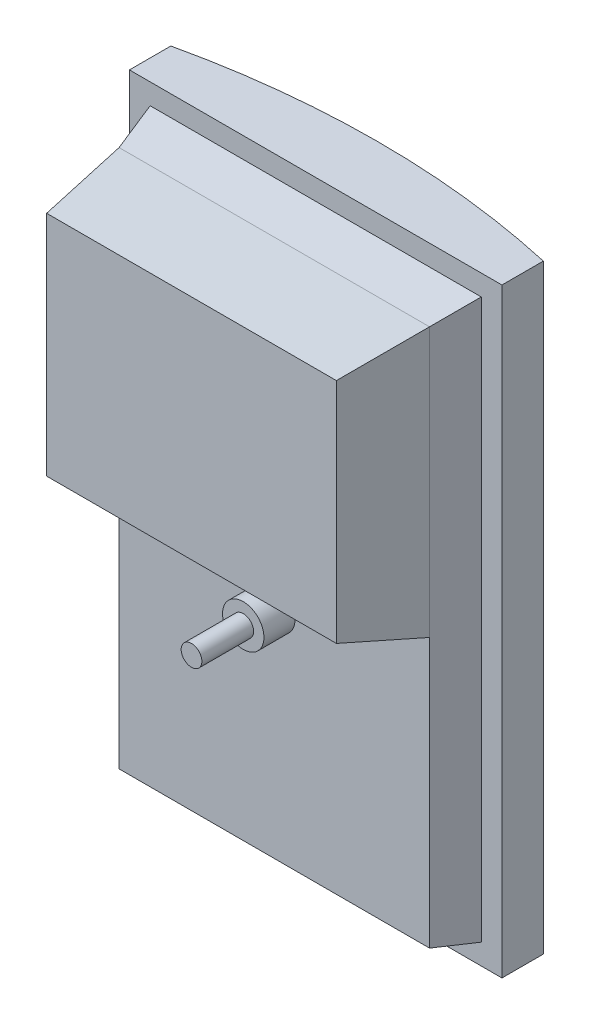
ISO-10303-21;
HEADER;
FILE_DESCRIPTION(('STEP AP214'),'2;1');
FILE_NAME('part.step','',(''),(''),'','','');
FILE_SCHEMA(('AUTOMOTIVE_DESIGN { 1 0 10303 214 1 1 1 1 }'));
ENDSEC;
DATA;
#1=APPLICATION_CONTEXT('core data for automotive mechanical design processes');
#2=APPLICATION_PROTOCOL_DEFINITION('international standard','automotive_design',2000,#1);
#3=PRODUCT_CONTEXT('',#1,'mechanical');
#4=PRODUCT('Part','Part','',(#3));
#5=PRODUCT_RELATED_PRODUCT_CATEGORY('part','',(#4));
#6=PRODUCT_DEFINITION_FORMATION('','',#4);
#7=PRODUCT_DEFINITION_CONTEXT('part definition',#1,'design');
#8=PRODUCT_DEFINITION('design','',#6,#7);
#9=PRODUCT_DEFINITION_SHAPE('','',#8);
#10=(LENGTH_UNIT() NAMED_UNIT(*) SI_UNIT(.MILLI.,.METRE.));
#11=(NAMED_UNIT(*) PLANE_ANGLE_UNIT() SI_UNIT($,.RADIAN.));
#12=(NAMED_UNIT(*) SI_UNIT($,.STERADIAN.) SOLID_ANGLE_UNIT());
#13=UNCERTAINTY_MEASURE_WITH_UNIT(LENGTH_MEASURE(1.E-05),#10,'distance_accuracy_value','');
#14=(GEOMETRIC_REPRESENTATION_CONTEXT(3) GLOBAL_UNCERTAINTY_ASSIGNED_CONTEXT((#13)) GLOBAL_UNIT_ASSIGNED_CONTEXT((#10,
#11,#12)) REPRESENTATION_CONTEXT('',''));
#15=CARTESIAN_POINT('',(0.,0.,0.));
#16=DIRECTION('',(0.,0.,1.));
#17=DIRECTION('',(1.,0.,0.));
#18=AXIS2_PLACEMENT_3D('',#15,#16,#17);
#19=CARTESIAN_POINT('',(0.,0.,15.875));
#20=DIRECTION('',(0.,0.,1.));
#21=DIRECTION('',(1.,0.,0.));
#22=AXIS2_PLACEMENT_3D('',#19,#20,#21);
#23=PLANE('',#22);
#24=CARTESIAN_POINT('',(0.,-25.4,15.875));
#25=DIRECTION('',(0.,0.,1.));
#26=DIRECTION('',(1.,0.,0.));
#27=AXIS2_PLACEMENT_3D('',#24,#25,#26);
#28=CIRCLE('',#27,3.175);
#29=CARTESIAN_POINT('',(3.175,-25.4,15.875));
#30=VERTEX_POINT('',#29);
#31=EDGE_CURVE('E693',#30,#30,#28,.T.);
#32=ORIENTED_EDGE('',*,*,#31,.F.);
#33=EDGE_LOOP('',(#32));
#34=FACE_BOUND('',#33,.T.);
#35=DIRECTION('',(0.,1.,0.));
#36=VECTOR('',#35,1.);
#37=CARTESIAN_POINT('',(23.8125,-58.7375,15.875));
#38=LINE('',#37,#36);
#39=CARTESIAN_POINT('',(23.8125,-58.7375,15.875));
#40=VERTEX_POINT('',#39);
#41=CARTESIAN_POINT('',(23.8125,-17.4625,15.875));
#42=VERTEX_POINT('',#41);
#43=EDGE_CURVE('E164',#40,#42,#38,.T.);
#44=ORIENTED_EDGE('',*,*,#43,.T.);
#45=DIRECTION('',(1.,0.,0.));
#46=VECTOR('',#45,1.);
#47=CARTESIAN_POINT('',(-23.8125,-17.4625,15.875));
#48=LINE('',#47,#46);
#49=CARTESIAN_POINT('',(-23.8125,-17.4625,15.875));
#50=VERTEX_POINT('',#49);
#51=EDGE_CURVE('E138',#50,#42,#48,.T.);
#52=ORIENTED_EDGE('',*,*,#51,.F.);
#53=DIRECTION('',(0.,-1.,0.));
#54=VECTOR('',#53,1.);
#55=CARTESIAN_POINT('',(-23.8125,23.8125,15.875));
#56=LINE('',#55,#54);
#57=CARTESIAN_POINT('',(-23.8125,-58.7375,15.875));
#58=VERTEX_POINT('',#57);
#59=EDGE_CURVE('E360',#50,#58,#56,.T.);
#60=ORIENTED_EDGE('',*,*,#59,.T.);
#61=DIRECTION('',(1.,0.,0.));
#62=VECTOR('',#61,1.);
#63=CARTESIAN_POINT('',(-23.8125,-58.7375,15.875));
#64=LINE('',#63,#62);
#65=EDGE_CURVE('E175',#58,#40,#64,.T.);
#66=ORIENTED_EDGE('',*,*,#65,.T.);
#67=EDGE_LOOP('',(#44,#52,#60,#66));
#68=FACE_BOUND('',#67,.T.);
#69=ADVANCED_FACE('F55',(#34,#68),#23,.T.);
#70=CARTESIAN_POINT('',(-28.575,-63.5,9.52500000000001));
#71=DIRECTION('',(0.,0.,1.));
#72=DIRECTION('',(1.,0.,0.));
#73=AXIS2_PLACEMENT_3D('',#70,#71,#72);
#74=PLANE('',#73);
#75=DIRECTION('',(0.,1.,0.));
#76=VECTOR('',#75,1.);
#77=CARTESIAN_POINT('',(28.575,-63.5,9.52500000000001));
#78=LINE('',#77,#76);
#79=CARTESIAN_POINT('',(28.575,-63.5,9.52500000000001));
#80=VERTEX_POINT('',#79);
#81=CARTESIAN_POINT('',(28.575,28.575,9.52500000000001));
#82=VERTEX_POINT('',#81);
#83=EDGE_CURVE('E63',#80,#82,#78,.T.);
#84=ORIENTED_EDGE('',*,*,#83,.T.);
#85=DIRECTION('',(1.,0.,0.));
#86=VECTOR('',#85,1.);
#87=CARTESIAN_POINT('',(-28.575,28.575,9.52500000000001));
#88=LINE('',#87,#86);
#89=CARTESIAN_POINT('',(-28.575,28.575,9.52500000000001));
#90=VERTEX_POINT('',#89);
#91=EDGE_CURVE('E244',#90,#82,#88,.T.);
#92=ORIENTED_EDGE('',*,*,#91,.F.);
#93=DIRECTION('',(0.,1.,0.));
#94=VECTOR('',#93,1.);
#95=CARTESIAN_POINT('',(-28.575,-63.5,9.52500000000001));
#96=LINE('',#95,#94);
#97=CARTESIAN_POINT('',(-28.575,-63.5,9.52500000000001));
#98=VERTEX_POINT('',#97);
#99=EDGE_CURVE('E261',#98,#90,#96,.T.);
#100=ORIENTED_EDGE('',*,*,#99,.F.);
#101=DIRECTION('',(1.,0.,0.));
#102=VECTOR('',#101,1.);
#103=CARTESIAN_POINT('',(-28.575,-63.5,9.52500000000001));
#104=LINE('',#103,#102);
#105=EDGE_CURVE('E256',#98,#80,#104,.T.);
#106=ORIENTED_EDGE('',*,*,#105,.T.);
#107=EDGE_LOOP('',(#84,#92,#100,#106));
#108=FACE_BOUND('',#107,.T.);
#109=DIRECTION('',(1.,0.,0.));
#110=VECTOR('',#109,1.);
#111=CARTESIAN_POINT('',(-25.4,-60.325,9.52500000000001));
#112=LINE('',#111,#110);
#113=CARTESIAN_POINT('',(-25.4,-60.325,9.52500000000001));
#114=VERTEX_POINT('',#113);
#115=CARTESIAN_POINT('',(25.4,-60.325,9.52500000000001));
#116=VERTEX_POINT('',#115);
#117=EDGE_CURVE('E270',#114,#116,#112,.T.);
#118=ORIENTED_EDGE('',*,*,#117,.F.);
#119=DIRECTION('',(0.,-1.,0.));
#120=VECTOR('',#119,1.);
#121=CARTESIAN_POINT('',(-25.4,25.4,9.52500000000001));
#122=LINE('',#121,#120);
#123=CARTESIAN_POINT('',(-25.4,25.4,9.52500000000001));
#124=VERTEX_POINT('',#123);
#125=EDGE_CURVE('E437',#124,#114,#122,.T.);
#126=ORIENTED_EDGE('',*,*,#125,.F.);
#127=DIRECTION('',(-1.,0.,0.));
#128=VECTOR('',#127,1.);
#129=CARTESIAN_POINT('',(25.4,25.4,9.52500000000001));
#130=LINE('',#129,#128);
#131=CARTESIAN_POINT('',(25.4,25.4,9.52500000000001));
#132=VERTEX_POINT('',#131);
#133=EDGE_CURVE('E407',#132,#124,#130,.T.);
#134=ORIENTED_EDGE('',*,*,#133,.F.);
#135=DIRECTION('',(0.,1.,0.));
#136=VECTOR('',#135,1.);
#137=CARTESIAN_POINT('',(25.4,-60.325,9.52500000000001));
#138=LINE('',#137,#136);
#139=EDGE_CURVE('E444',#116,#132,#138,.T.);
#140=ORIENTED_EDGE('',*,*,#139,.F.);
#141=EDGE_LOOP('',(#118,#126,#134,#140));
#142=FACE_BOUND('',#141,.T.);
#143=ADVANCED_FACE('F195',(#108,#142),#74,.T.);
#144=CARTESIAN_POINT('',(0.,-63.5,130.175));
#145=DIRECTION('',(0.,1.,0.));
#146=DIRECTION('',(0.,0.,1.));
#147=AXIS2_PLACEMENT_3D('',#144,#145,#146);
#148=CYLINDRICAL_SURFACE('',#147,130.175);
#149=DIRECTION('',(0.,1.,0.));
#150=VECTOR('',#149,1.);
#151=CARTESIAN_POINT('',(-28.575,-63.5,3.17500000000001));
#152=LINE('',#151,#150);
#153=CARTESIAN_POINT('',(-28.575,-63.5,3.17500000000001));
#154=VERTEX_POINT('',#153);
#155=CARTESIAN_POINT('',(-28.575,28.575,3.17500000000001));
#156=VERTEX_POINT('',#155);
#157=EDGE_CURVE('E263',#154,#156,#152,.T.);
#158=ORIENTED_EDGE('',*,*,#157,.T.);
#159=CARTESIAN_POINT('',(0.,28.575,130.175));
#160=DIRECTION('',(0.,1.,0.));
#161=DIRECTION('',(0.,0.,-1.));
#162=AXIS2_PLACEMENT_3D('',#159,#160,#161);
#163=CIRCLE('',#162,130.175);
#164=CARTESIAN_POINT('',(28.575,28.575,3.17500000000001));
#165=VERTEX_POINT('',#164);
#166=EDGE_CURVE('E238',#165,#156,#163,.T.);
#167=ORIENTED_EDGE('',*,*,#166,.F.);
#168=DIRECTION('',(0.,1.,0.));
#169=VECTOR('',#168,1.);
#170=CARTESIAN_POINT('',(28.575,-63.5,3.17500000000001));
#171=LINE('',#170,#169);
#172=CARTESIAN_POINT('',(28.575,-63.5,3.17500000000001));
#173=VERTEX_POINT('',#172);
#174=EDGE_CURVE('E259',#173,#165,#171,.T.);
#175=ORIENTED_EDGE('',*,*,#174,.F.);
#176=CARTESIAN_POINT('',(0.,-63.5,130.175));
#177=DIRECTION('',(0.,1.,0.));
#178=DIRECTION('',(0.,0.,-1.));
#179=AXIS2_PLACEMENT_3D('',#176,#177,#178);
#180=CIRCLE('',#179,130.175);
#181=EDGE_CURVE('E250',#173,#154,#180,.T.);
#182=ORIENTED_EDGE('',*,*,#181,.T.);
#183=EDGE_LOOP('',(#158,#167,#175,#182));
#184=FACE_BOUND('',#183,.T.);
#185=CARTESIAN_POINT('',(-10.5814764401766,-10.3997360062827,0.43077862060294));
#186=CARTESIAN_POINT('',(-10.2475320201912,-10.7248111111136,0.403543525407805));
#187=CARTESIAN_POINT('',(-9.8982653280884,-11.0341717162906,0.376358008907359));
#188=CARTESIAN_POINT('',(-9.17214231509208,-11.6190805583395,0.32302663974084));
#189=CARTESIAN_POINT('',(-8.79527239933886,-11.8946119527667,0.296881309292374));
#190=CARTESIAN_POINT('',(-8.01683965269437,-12.4099251952632,0.246507172340556));
#191=CARTESIAN_POINT('',(-7.61523774644518,-12.649648309335,0.22228154449925));
#192=CARTESIAN_POINT('',(-6.79150560240126,-13.0908813030051,0.176630275215758));
#193=CARTESIAN_POINT('',(-6.36937948534354,-13.2923988138313,0.155204074879293));
#194=CARTESIAN_POINT('',(-5.54930583180882,-13.6383689699672,0.117751347907168));
#195=CARTESIAN_POINT('',(-5.15288962469618,-13.7864302801077,0.101404785911512));
#196=CARTESIAN_POINT('',(-4.34901613821411,-14.0490982917784,0.0720469110607314));
#197=CARTESIAN_POINT('',(-3.94155943516088,-14.1637067358927,0.0590354244834078));
#198=CARTESIAN_POINT('',(-3.11873215610405,-14.3586754467421,0.0367143071494964));
#199=CARTESIAN_POINT('',(-2.70336718252545,-14.439059080398,0.0274021509742835));
#200=CARTESIAN_POINT('',(-1.86733419864298,-14.5651837384506,0.012722529467308));
#201=CARTESIAN_POINT('',(-1.44666608453016,-14.610924083631,0.00735514147671248));
#202=CARTESIAN_POINT('',(-0.598544199070941,-14.6677632548024,0.000678141499465925));
#203=CARTESIAN_POINT('',(-0.171065453979857,-14.678495110996,-0.000588483997330389));
#204=CARTESIAN_POINT('',(0.683287232700605,-14.6642174318487,0.00109236608770178));
#205=CARTESIAN_POINT('',(1.11016117159796,-14.6392077379176,0.00403986036818226));
#206=CARTESIAN_POINT('',(1.96034909836225,-14.5536022531692,0.0140672284634172));
#207=CARTESIAN_POINT('',(2.3836624844695,-14.4930005649291,0.0211477871059269));
#208=CARTESIAN_POINT('',(3.22365148883319,-14.3366001559824,0.0392432577824273));
#209=CARTESIAN_POINT('',(3.64032710790701,-14.2408014396099,0.0502581693319453));
#210=CARTESIAN_POINT('',(4.46458748252737,-14.0144880193138,0.0759288162287105));
#211=CARTESIAN_POINT('',(4.87216026083181,-13.8839301973432,0.0905890720583394));
#212=CARTESIAN_POINT('',(5.67475371220852,-13.5890033173576,0.123129133867888));
#213=CARTESIAN_POINT('',(6.06977435307273,-13.4246341725927,0.141008948108228));
#214=CARTESIAN_POINT('',(6.84440615852998,-13.0631575512504,0.179480338574415));
#215=CARTESIAN_POINT('',(7.22401733337053,-12.8660500964447,0.200071912996867));
#216=CARTESIAN_POINT('',(7.96505453399436,-12.4403887347139,0.243378350739827));
#217=CARTESIAN_POINT('',(8.32648064534723,-12.2118349757777,0.266093204067836));
#218=CARTESIAN_POINT('',(9.02678726723691,-11.7259558227178,0.312879552058849));
#219=CARTESIAN_POINT('',(9.36576738186777,-11.4687733317582,0.336944035216891));
#220=CARTESIAN_POINT('',(10.0205258376184,-10.9264559676615,0.385834481346716));
#221=CARTESIAN_POINT('',(10.3363041908237,-10.6413211090844,0.410660443921846));
#222=CARTESIAN_POINT('',(10.9422266479501,-10.0450276189102,0.460348834613014));
#223=CARTESIAN_POINT('',(11.2323719691595,-9.73387022446577,0.485211260940359));
#224=CARTESIAN_POINT('',(11.7847633556542,-9.08765053828816,0.534239089695355));
#225=CARTESIAN_POINT('',(12.0470098090477,-8.7525885792056,0.558404501815934));
#226=CARTESIAN_POINT('',(12.5376343074369,-8.06629199021116,0.604948875011587));
#227=CARTESIAN_POINT('',(12.7664760511104,-7.71539033675946,0.627349790523851));
#228=CARTESIAN_POINT('',(13.1932241498644,-6.99513069452748,0.670114098597908));
#229=CARTESIAN_POINT('',(13.3911307587208,-6.62577285718504,0.690477507873861));
#230=CARTESIAN_POINT('',(13.7543409695807,-5.87127987924402,0.728555119270967));
#231=CARTESIAN_POINT('',(13.9196485799574,-5.48614668542544,0.746269647033783));
#232=CARTESIAN_POINT('',(14.2162757675824,-4.70287654642349,0.778514693603715));
#233=CARTESIAN_POINT('',(14.3475959994437,-4.30473985186006,0.79304527373434));
#234=CARTESIAN_POINT('',(14.5722985247756,-3.50836778465167,0.818163262100439));
#235=CARTESIAN_POINT('',(14.6665350926071,-3.11037607047234,0.82883892732637));
#236=CARTESIAN_POINT('',(14.820780335207,-2.30773293734742,0.846421817243654));
#237=CARTESIAN_POINT('',(14.880789584447,-1.90308163029378,0.853329105183399));
#238=CARTESIAN_POINT('',(14.9660584791084,-1.09012914526026,0.863169273951734));
#239=CARTESIAN_POINT('',(14.991321815479,-0.681828359591506,0.866102576923775));
#240=CARTESIAN_POINT('',(15.0068906497119,0.13544720946221,0.867908457000796));
#241=CARTESIAN_POINT('',(14.99719644961,0.54442198699332,0.866781069190449));
#242=CARTESIAN_POINT('',(14.9434210284197,1.35273617379057,0.86055572096213));
#243=CARTESIAN_POINT('',(14.8999563844793,1.75211731151827,0.855528957527996));
#244=CARTESIAN_POINT('',(14.7797542776799,2.54576881068955,0.841736135192712));
#245=CARTESIAN_POINT('',(14.703017297499,2.94003924618807,0.832970130536347));
#246=CARTESIAN_POINT('',(14.5169058750634,3.7206982084886,0.811949537071009));
#247=CARTESIAN_POINT('',(14.4075316537027,4.10708678861735,0.799694971873194));
#248=CARTESIAN_POINT('',(14.1570341280545,4.8693142550006,0.772044577787421));
#249=CARTESIAN_POINT('',(14.0159105633179,5.24515305468369,0.756648723130634));
#250=CARTESIAN_POINT('',(13.7024741163844,5.98505690556747,0.723087146478292));
#251=CARTESIAN_POINT('',(13.5300509344578,6.34907477374322,0.70491166596074));
#252=CARTESIAN_POINT('',(13.1557043998741,7.06148129542268,0.666338313425829));
#253=CARTESIAN_POINT('',(12.953781068275,7.40986996008273,0.645940442994879));
#254=CARTESIAN_POINT('',(12.5219514069154,8.08877253218288,0.603481488504954));
#255=CARTESIAN_POINT('',(12.2920430579789,8.41928514734165,0.581420284476828));
#256=CARTESIAN_POINT('',(11.8059501111186,9.06030804037419,0.536233691299157));
#257=CARTESIAN_POINT('',(11.5497650959618,9.37081800050909,0.513108285254935));
#258=CARTESIAN_POINT('',(11.0071723807396,9.97635609188879,0.465908171346051));
#259=CARTESIAN_POINT('',(10.7202326445031,10.2709068239583,0.44182374481294));
#260=CARTESIAN_POINT('',(10.1229415444111,10.8352425761252,0.393851814835957));
#261=CARTESIAN_POINT('',(9.81258989524308,11.1050272943194,0.369964313795881));
#262=CARTESIAN_POINT('',(9.17065472062841,11.6181672495348,0.323033230863269));
#263=CARTESIAN_POINT('',(8.83906929767855,11.8615201192862,0.299989724682276));
#264=CARTESIAN_POINT('',(8.15700099330384,12.3202699454218,0.255368116045672));
#265=CARTESIAN_POINT('',(7.80651787737871,12.5356665547854,0.233790031781898));
#266=CARTESIAN_POINT('',(7.08080440797474,12.9418042310195,0.192201454329319));
#267=CARTESIAN_POINT('',(6.70519046164785,13.1318650284165,0.172238374782885));
#268=CARTESIAN_POINT('',(5.9393509189147,13.4801477014016,0.134999616205304));
#269=CARTESIAN_POINT('',(5.54912510389333,13.6383691003994,0.117723977402187));
#270=CARTESIAN_POINT('',(4.75677262205732,13.9219793237663,0.0863343434177621));
#271=CARTESIAN_POINT('',(4.35464531110391,14.0473663674278,0.072220519717369));
#272=CARTESIAN_POINT('',(3.54130418969585,14.2645053918092,0.0475420337458561));
#273=CARTESIAN_POINT('',(3.1300903380755,14.3562572201148,0.0369773875574575));
#274=CARTESIAN_POINT('',(2.29614526282047,14.5064961728234,0.0195757212679969));
#275=CARTESIAN_POINT('',(1.87333407622309,14.5645454684682,0.0127878097957013));
#276=CARTESIAN_POINT('',(1.02429531896615,14.6451773569789,0.00333762930857149));
#277=CARTESIAN_POINT('',(0.598067715736873,14.6677596113219,0.000675399672215714));
#278=CARTESIAN_POINT('',(-0.254804091908328,14.6773107568793,-0.000449108205873575));
#279=CARTESIAN_POINT('',(-0.681448307502189,14.6642786647464,0.00108872952042171));
#280=CARTESIAN_POINT('',(-1.53212839892757,14.6026833879896,0.00832169950090659));
#281=CARTESIAN_POINT('',(-1.95616427508767,14.5541202078417,0.0140168312313969));
#282=CARTESIAN_POINT('',(-2.80004265767455,14.4215552140965,0.029431200458755));
#283=CARTESIAN_POINT('',(-3.21986637930816,14.3374353346068,0.039163842476418));
#284=CARTESIAN_POINT('',(-4.0508785484306,14.1342898785292,0.0623803154262707));
#285=CARTESIAN_POINT('',(-4.46206696176723,14.0152641639184,0.0758641611912747));
#286=CARTESIAN_POINT('',(-5.27286996347488,13.7430797559066,0.106202566570401));
#287=CARTESIAN_POINT('',(-5.67248432224505,13.5899203859009,0.123057193000183));
#288=CARTESIAN_POINT('',(-6.45724796044222,13.2504691318218,0.159659023070615));
#289=CARTESIAN_POINT('',(-6.84239728205758,13.0641773443907,0.179406218274048));
#290=CARTESIAN_POINT('',(-7.59451891155821,12.6601679953273,0.221179565157382));
#291=CARTESIAN_POINT('',(-7.96153278803092,12.4425272497725,0.243200110008307));
#292=CARTESIAN_POINT('',(-8.67568021861223,11.9769112605604,0.288929751364519));
#293=CARTESIAN_POINT('',(-9.02281375574237,11.728935990997,0.312638849311847));
#294=CARTESIAN_POINT('',(-9.69460031145634,11.2042964453349,0.361060901783805));
#295=CARTESIAN_POINT('',(-10.0192536902383,10.9276326290883,0.385773840213893));
#296=CARTESIAN_POINT('',(-10.6436059660999,10.3474700530562,0.435482605581813));
#297=CARTESIAN_POINT('',(-10.9433051248844,10.0439715747653,0.460478429549788));
#298=CARTESIAN_POINT('',(-11.5121136920144,9.41584790975601,0.509729227275789));
#299=CARTESIAN_POINT('',(-11.781535251315,9.09150582264878,0.533989415141792));
#300=CARTESIAN_POINT('',(-12.2915877839877,8.42083660791665,0.581353859857227));
#301=CARTESIAN_POINT('',(-12.5322189030131,8.07450959152898,0.60445812255424));
#302=CARTESIAN_POINT('',(-12.9827189651198,7.36232556896188,0.648821623435107));
#303=CARTESIAN_POINT('',(-13.1925910366321,6.99647055410017,0.670081049163182));
#304=CARTESIAN_POINT('',(-13.5798488242373,6.24782113159389,0.710115761544872));
#305=CARTESIAN_POINT('',(-13.757235156947,5.86502704564372,0.728891095347544));
#306=CARTESIAN_POINT('',(-14.0743521328706,5.09418159010462,0.762990890753586));
#307=CARTESIAN_POINT('',(-14.2148472587349,4.70644765566503,0.77838410930938));
#308=CARTESIAN_POINT('',(-14.4621786742503,3.92027083238728,0.805793797350047));
#309=CARTESIAN_POINT('',(-14.5690154469817,3.52182809733594,0.817810315298641));
#310=CARTESIAN_POINT('',(-14.748096241462,2.7172200093793,0.838104977989997));
#311=CARTESIAN_POINT('',(-14.8203462777785,2.31105601196872,0.846383772701459));
#312=CARTESIAN_POINT('',(-14.9296485476954,1.49395913069015,0.858955915331931));
#313=CARTESIAN_POINT('',(-14.9667013106446,1.08302631863675,0.863249323189076));
#314=CARTESIAN_POINT('',(-15.0048516544514,0.268710578196828,0.867670728218704));
#315=CARTESIAN_POINT('',(-15.0067363376808,-0.134635183575316,0.867889910840141));
#316=CARTESIAN_POINT('',(-14.976543130732,-0.940033298977944,0.864389404123915));
#317=CARTESIAN_POINT('',(-14.9444656575863,-1.34208566842962,0.860669763152374));
#318=CARTESIAN_POINT('',(-14.8466065983733,-2.14211828052322,0.849398064424446));
#319=CARTESIAN_POINT('',(-14.7808161061554,-2.5400974187667,0.841844993975284));
#320=CARTESIAN_POINT('',(-14.616078736967,-3.32903724568259,0.823124373035766));
#321=CARTESIAN_POINT('',(-14.517132370306,-3.71999804227828,0.811956878175909));
#322=CARTESIAN_POINT('',(-14.2873200693414,-4.49075272036588,0.786374489609967));
#323=CARTESIAN_POINT('',(-14.1565719324562,-4.87058214559119,0.771971594912997));
#324=CARTESIAN_POINT('',(-13.8640186809674,-5.61796379847712,0.740301244392315));
#325=CARTESIAN_POINT('',(-13.7022130755115,-5.9855158319901,0.723033743295097));
#326=CARTESIAN_POINT('',(-13.3490279622724,-6.70543723016922,0.686137381811233));
#327=CARTESIAN_POINT('',(-13.1576849595429,-7.05782465835069,0.66651144274576));
#328=CARTESIAN_POINT('',(-12.7468038659879,-7.74548966963425,0.625425647197296));
#329=CARTESIAN_POINT('',(-12.5272739367024,-8.08077216636453,0.603966322171674));
#330=CARTESIAN_POINT('',(-12.0393462182376,-8.76332187367988,0.557677135260324));
#331=CARTESIAN_POINT('',(-11.7682842882616,-9.10868004253965,0.532721041777274));
#332=CARTESIAN_POINT('',(-11.1965013265798,-9.77391375666214,0.482088283294906));
#333=CARTESIAN_POINT('',(-10.8957751348338,-10.0937848509426,0.456411493489603));
#334=CARTESIAN_POINT('',(-10.5814764401766,-10.3997360062827,0.43077862060294));
#335=B_SPLINE_CURVE_WITH_KNOTS('',3,(#185,#186,#187,#188,#189,#190,#191,#192,#193,#194,#195,
#196,#197,#198,#199,#200,#201,#202,#203,#204,#205,#206,#207,#208,#209,#210,#211,#212,#213,#214,
#215,#216,#217,#218,#219,#220,#221,#222,#223,#224,#225,#226,#227,#228,#229,#230,#231,#232,#233,
#234,#235,#236,#237,#238,#239,#240,#241,#242,#243,#244,#245,#246,#247,#248,#249,#250,#251,#252,
#253,#254,#255,#256,#257,#258,#259,#260,#261,#262,#263,#264,#265,#266,#267,#268,#269,#270,#271,
#272,#273,#274,#275,#276,#277,#278,#279,#280,#281,#282,#283,#284,#285,#286,#287,#288,#289,#290,
#291,#292,#293,#294,#295,#296,#297,#298,#299,#300,#301,#302,#303,#304,#305,#306,#307,#308,#309,
#310,#311,#312,#313,#314,#315,#316,#317,#318,#319,#320,#321,#322,#323,#324,#325,#326,#327,#328,
#329,#330,#331,#332,#333,#334),.UNSPECIFIED.,.T.,.F.,(4,2,2,2,2,2,2,2,2,2,2,2,2,2,2,2,2,2,2,2,2,
2,2,2,2,2,2,2,2,2,2,2,2,2,2,2,2,2,2,2,2,2,2,2,2,2,2,2,2,2,2,2,2,2,2,2,2,2,2,2,2,2,2,2,2,2,2,2,2,
2,2,2,2,2,4),(0.,1.40002247860093,2.80073917969941,4.20372873555211,5.60643776085786,
6.8754247418598,8.14434560860614,9.41239872748443,10.6804767071624,11.9618050673127,
13.2431391129177,14.5246855293515,15.8062317879769,17.089375249318,18.3725220028667,
19.6556679030919,20.9388077649256,22.2158078907406,23.4928073513823,24.7697461359081,
26.0466671542992,27.3037093626421,28.5607412583164,29.8176184928309,31.0744715174947,
32.3003871567575,33.5262822196363,34.7520470494707,35.9778012886304,37.1816871064984,
38.3855554603138,39.5894156663416,40.7932857483505,42.0014836642247,43.2096807176568,
44.4179649966992,45.6262684644077,46.8605926243164,48.0949318289145,49.3293814914971,
50.5638464758135,51.8266772640795,53.0895269537139,54.3524451173779,55.6153690037444,
56.8943521883703,58.1733475804577,59.4523782872344,60.73140883289,62.0147201776195,
63.2980365968239,64.5813784564655,65.8647165728534,67.144961925364,68.4252083712302,
69.705434299042,70.9856467989258,72.2511366368671,73.5166200723151,74.7819747089448,
76.047305325192,77.2838657404127,78.5204084071302,79.7567359632488,80.9930449253455,
82.2016498280444,83.4102398900546,84.6191493965704,85.8280402973461,87.0325197542987,
88.2370182491908,89.4400398583952,90.6427139142768,91.9601444433907,93.2778045424404),.UNSPECIFIED.);
#336=CARTESIAN_POINT('',(-10.5814764401766,-10.3997360062827,0.43077862060294));
#337=VERTEX_POINT('',#336);
#338=EDGE_CURVE('E234',#337,#337,#335,.T.);
#339=ORIENTED_EDGE('',*,*,#338,.T.);
#340=EDGE_LOOP('',(#339));
#341=FACE_BOUND('',#340,.T.);
#342=ADVANCED_FACE('F272',(#184,#341),#148,.T.);
#343=CARTESIAN_POINT('',(28.575,-63.5,3.17500000000001));
#344=DIRECTION('',(1.,0.,0.));
#345=DIRECTION('',(0.,0.,-1.));
#346=AXIS2_PLACEMENT_3D('',#343,#344,#345);
#347=PLANE('',#346);
#348=ORIENTED_EDGE('',*,*,#174,.T.);
#349=DIRECTION('',(0.,0.,-1.));
#350=VECTOR('',#349,1.);
#351=CARTESIAN_POINT('',(28.575,28.575,3.17500000000001));
#352=LINE('',#351,#350);
#353=EDGE_CURVE('E235',#82,#165,#352,.T.);
#354=ORIENTED_EDGE('',*,*,#353,.F.);
#355=ORIENTED_EDGE('',*,*,#83,.F.);
#356=DIRECTION('',(0.,0.,-1.));
#357=VECTOR('',#356,1.);
#358=CARTESIAN_POINT('',(28.575,-63.5,3.17500000000001));
#359=LINE('',#358,#357);
#360=EDGE_CURVE('E247',#80,#173,#359,.T.);
#361=ORIENTED_EDGE('',*,*,#360,.T.);
#362=EDGE_LOOP('',(#348,#354,#355,#361));
#363=FACE_BOUND('',#362,.T.);
#364=ADVANCED_FACE('F57',(#363),#347,.T.);
#365=CARTESIAN_POINT('',(-28.575,-63.5,3.17500000000001));
#366=DIRECTION('',(-1.,0.,0.));
#367=DIRECTION('',(0.,0.,1.));
#368=AXIS2_PLACEMENT_3D('',#365,#366,#367);
#369=PLANE('',#368);
#370=ORIENTED_EDGE('',*,*,#99,.T.);
#371=DIRECTION('',(0.,0.,1.));
#372=VECTOR('',#371,1.);
#373=CARTESIAN_POINT('',(-28.575,28.575,3.17500000000001));
#374=LINE('',#373,#372);
#375=EDGE_CURVE('E241',#156,#90,#374,.T.);
#376=ORIENTED_EDGE('',*,*,#375,.F.);
#377=ORIENTED_EDGE('',*,*,#157,.F.);
#378=DIRECTION('',(0.,0.,1.));
#379=VECTOR('',#378,1.);
#380=CARTESIAN_POINT('',(-28.575,-63.5,3.17500000000001));
#381=LINE('',#380,#379);
#382=EDGE_CURVE('E253',#154,#98,#381,.T.);
#383=ORIENTED_EDGE('',*,*,#382,.T.);
#384=EDGE_LOOP('',(#370,#376,#377,#383));
#385=FACE_BOUND('',#384,.T.);
#386=ADVANCED_FACE('F277',(#385),#369,.T.);
#387=CARTESIAN_POINT('',(0.,-63.5,130.175));
#388=DIRECTION('',(0.,-1.,0.));
#389=DIRECTION('',(0.,0.,-1.));
#390=AXIS2_PLACEMENT_3D('',#387,#388,#389);
#391=PLANE('',#390);
#392=ORIENTED_EDGE('',*,*,#360,.F.);
#393=ORIENTED_EDGE('',*,*,#105,.F.);
#394=ORIENTED_EDGE('',*,*,#382,.F.);
#395=ORIENTED_EDGE('',*,*,#181,.F.);
#396=EDGE_LOOP('',(#392,#393,#394,#395));
#397=FACE_BOUND('',#396,.T.);
#398=ADVANCED_FACE('F280',(#397),#391,.T.);
#399=CARTESIAN_POINT('',(0.,28.575,130.175));
#400=DIRECTION('',(0.,-1.,0.));
#401=DIRECTION('',(0.,0.,-1.));
#402=AXIS2_PLACEMENT_3D('',#399,#400,#401);
#403=PLANE('',#402);
#404=ORIENTED_EDGE('',*,*,#353,.T.);
#405=ORIENTED_EDGE('',*,*,#166,.T.);
#406=ORIENTED_EDGE('',*,*,#375,.T.);
#407=ORIENTED_EDGE('',*,*,#91,.T.);
#408=EDGE_LOOP('',(#404,#405,#406,#407));
#409=FACE_BOUND('',#408,.T.);
#410=ADVANCED_FACE('F287',(#409),#403,.F.);
#411=CARTESIAN_POINT('',(0.,0.,-8.5278073100087));
#412=DIRECTION('',(0.,0.,1.));
#413=DIRECTION('',(1.,0.,0.));
#414=AXIS2_PLACEMENT_3D('',#411,#412,#413);
#415=PLANE('',#414);
#416=CARTESIAN_POINT('',(0.,0.,-8.5278073100087));
#417=DIRECTION('',(0.,0.,1.));
#418=DIRECTION('',(1.,0.,0.));
#419=AXIS2_PLACEMENT_3D('',#416,#417,#418);
#420=CIRCLE('',#419,6.35);
#421=CARTESIAN_POINT('',(6.35,0.,-8.5278073100087));
#422=VERTEX_POINT('',#421);
#423=EDGE_CURVE('E231',#422,#422,#420,.T.);
#424=ORIENTED_EDGE('',*,*,#423,.F.);
#425=EDGE_LOOP('',(#424));
#426=FACE_BOUND('',#425,.T.);
#427=ADVANCED_FACE('F291',(#426),#415,.F.);
#428=CARTESIAN_POINT('',(0.,0.,-8.5278073100087));
#429=DIRECTION('',(0.,0.,-1.));
#430=DIRECTION('',(-1.,0.,0.));
#431=AXIS2_PLACEMENT_3D('',#428,#429,#430);
#432=CONICAL_SURFACE('',#431,6.35,0.753022816859761);
#433=CARTESIAN_POINT('',(0.,0.,-9.52499999999999));
#434=DIRECTION('',(0.,0.,1.));
#435=DIRECTION('',(1.,0.,0.));
#436=AXIS2_PLACEMENT_3D('',#433,#434,#435);
#437=CIRCLE('',#436,7.28462748145115);
#438=CARTESIAN_POINT('',(7.28462748145115,0.,-9.52499999999999));
#439=VERTEX_POINT('',#438);
#440=EDGE_CURVE('E228',#439,#439,#437,.T.);
#441=ORIENTED_EDGE('',*,*,#440,.F.);
#442=EDGE_LOOP('',(#441));
#443=FACE_BOUND('',#442,.T.);
#444=ORIENTED_EDGE('',*,*,#423,.T.);
#445=EDGE_LOOP('',(#444));
#446=FACE_BOUND('',#445,.T.);
#447=ADVANCED_FACE('F295',(#443,#446),#432,.F.);
#448=CARTESIAN_POINT('',(0.,7.28462748145115,-9.52499999999999));
#449=DIRECTION('',(0.,0.,1.));
#450=DIRECTION('',(1.,0.,0.));
#451=AXIS2_PLACEMENT_3D('',#448,#449,#450);
#452=PLANE('',#451);
#453=CARTESIAN_POINT('',(0.,0.,-9.52499999999999));
#454=DIRECTION('',(0.,0.,1.));
#455=DIRECTION('',(1.,0.,0.));
#456=AXIS2_PLACEMENT_3D('',#453,#454,#455);
#457=CIRCLE('',#456,8.87212748145115);
#458=CARTESIAN_POINT('',(8.87212748145115,0.,-9.52499999999999));
#459=VERTEX_POINT('',#458);
#460=EDGE_CURVE('E225',#459,#459,#457,.T.);
#461=ORIENTED_EDGE('',*,*,#460,.F.);
#462=EDGE_LOOP('',(#461));
#463=FACE_BOUND('',#462,.T.);
#464=ORIENTED_EDGE('',*,*,#440,.T.);
#465=EDGE_LOOP('',(#464));
#466=FACE_BOUND('',#465,.T.);
#467=ADVANCED_FACE('F299',(#463,#466),#452,.F.);
#468=CARTESIAN_POINT('',(0.,0.,-9.52499999999999));
#469=DIRECTION('',(0.,0.,1.));
#470=DIRECTION('',(1.,0.,0.));
#471=AXIS2_PLACEMENT_3D('',#468,#469,#470);
#472=CONICAL_SURFACE('',#471,8.87212748145115,0.240351294255251);
#473=CARTESIAN_POINT('',(0.,0.,-6.34999999999999));
#474=DIRECTION('',(0.,0.,1.));
#475=DIRECTION('',(1.,0.,0.));
#476=AXIS2_PLACEMENT_3D('',#473,#474,#475);
#477=CIRCLE('',#476,9.65028526821406);
#478=CARTESIAN_POINT('',(9.65028526821406,0.,-6.34999999999999));
#479=VERTEX_POINT('',#478);
#480=EDGE_CURVE('E221',#479,#479,#477,.T.);
#481=ORIENTED_EDGE('',*,*,#480,.F.);
#482=EDGE_LOOP('',(#481));
#483=FACE_BOUND('',#482,.T.);
#484=ORIENTED_EDGE('',*,*,#460,.T.);
#485=EDGE_LOOP('',(#484));
#486=FACE_BOUND('',#485,.T.);
#487=ADVANCED_FACE('F303',(#483,#486),#472,.T.);
#488=CARTESIAN_POINT('',(0.,0.,-6.34999999999999));
#489=DIRECTION('',(0.,0.,1.));
#490=DIRECTION('',(1.,0.,0.));
#491=AXIS2_PLACEMENT_3D('',#488,#489,#490);
#492=CONICAL_SURFACE('',#491,9.65028526821406,1.21451448106971);
#493=CARTESIAN_POINT('',(0.,0.,-5.21500649820256));
#494=DIRECTION('',(0.,0.,1.));
#495=DIRECTION('',(1.,0.,0.));
#496=AXIS2_PLACEMENT_3D('',#493,#494,#495);
#497=CIRCLE('',#496,12.7);
#498=CARTESIAN_POINT('',(12.7,0.,-5.21500649820256));
#499=VERTEX_POINT('',#498);
#500=EDGE_CURVE('E213',#499,#499,#497,.T.);
#501=ORIENTED_EDGE('',*,*,#500,.F.);
#502=EDGE_LOOP('',(#501));
#503=FACE_BOUND('',#502,.T.);
#504=ORIENTED_EDGE('',*,*,#480,.T.);
#505=EDGE_LOOP('',(#504));
#506=FACE_BOUND('',#505,.T.);
#507=ADVANCED_FACE('F306',(#503,#506),#492,.T.);
#508=CARTESIAN_POINT('',(0.,0.,-5.21500649820256));
#509=DIRECTION('',(0.,0.,1.));
#510=DIRECTION('',(1.,0.,0.));
#511=AXIS2_PLACEMENT_3D('',#508,#509,#510);
#512=CONICAL_SURFACE('',#511,12.7,0.361771252946483);
#513=ORIENTED_EDGE('',*,*,#338,.F.);
#514=EDGE_LOOP('',(#513));
#515=FACE_BOUND('',#514,.T.);
#516=ORIENTED_EDGE('',*,*,#500,.T.);
#517=EDGE_LOOP('',(#516));
#518=FACE_BOUND('',#517,.T.);
#519=ADVANCED_FACE('F200',(#515,#518),#512,.T.);
#520=CARTESIAN_POINT('',(0.,26.1470588235294,6.53676470588235));
#521=DIRECTION('',(0.,-0.970142500145332,-0.242535625036333));
#522=DIRECTION('',(0.,0.242535625036333,-0.970142500145332));
#523=AXIS2_PLACEMENT_3D('',#520,#521,#522);
#524=PLANE('',#523);
#525=DIRECTION('',(0.235702260395516,-0.235702260395516,0.942809041582063));
#526=VECTOR('',#525,1.);
#527=CARTESIAN_POINT('',(-25.4,25.4,9.52500000000001));
#528=LINE('',#527,#526);
#529=CARTESIAN_POINT('',(-23.8125,23.8125,15.875));
#530=VERTEX_POINT('',#529);
#531=EDGE_CURVE('E403',#124,#530,#528,.T.);
#532=ORIENTED_EDGE('',*,*,#531,.T.);
#533=DIRECTION('',(-1.,0.,0.));
#534=VECTOR('',#533,1.);
#535=CARTESIAN_POINT('',(23.8125,23.8125,15.875));
#536=LINE('',#535,#534);
#537=CARTESIAN_POINT('',(23.8125,23.8125,15.875));
#538=VERTEX_POINT('',#537);
#539=EDGE_CURVE('E177',#538,#530,#536,.T.);
#540=ORIENTED_EDGE('',*,*,#539,.F.);
#541=DIRECTION('',(-0.235702260395516,-0.235702260395516,0.942809041582063));
#542=VECTOR('',#541,1.);
#543=CARTESIAN_POINT('',(25.4,25.4,9.52500000000001));
#544=LINE('',#543,#542);
#545=EDGE_CURVE('E168',#132,#538,#544,.T.);
#546=ORIENTED_EDGE('',*,*,#545,.F.);
#547=ORIENTED_EDGE('',*,*,#133,.T.);
#548=EDGE_LOOP('',(#532,#540,#546,#547));
#549=FACE_BOUND('',#548,.T.);
#550=ADVANCED_FACE('F313',(#549),#524,.F.);
#551=CARTESIAN_POINT('',(26.1470588235294,0.,6.53676470588235));
#552=DIRECTION('',(-0.970142500145332,0.,-0.242535625036333));
#553=DIRECTION('',(-0.242535625036333,0.,0.970142500145332));
#554=AXIS2_PLACEMENT_3D('',#551,#552,#553);
#555=PLANE('',#554);
#556=ORIENTED_EDGE('',*,*,#545,.T.);
#557=DIRECTION('',(0.,1.,0.));
#558=VECTOR('',#557,1.);
#559=CARTESIAN_POINT('',(23.8125,-17.4625,15.875));
#560=LINE('',#559,#558);
#561=EDGE_CURVE('E146',#42,#538,#560,.T.);
#562=ORIENTED_EDGE('',*,*,#561,.F.);
#563=ORIENTED_EDGE('',*,*,#43,.F.);
#564=DIRECTION('',(-0.235702260395516,0.235702260395516,0.942809041582063));
#565=VECTOR('',#564,1.);
#566=CARTESIAN_POINT('',(25.4,-60.325,9.52500000000001));
#567=LINE('',#566,#565);
#568=EDGE_CURVE('E411',#116,#40,#567,.T.);
#569=ORIENTED_EDGE('',*,*,#568,.F.);
#570=ORIENTED_EDGE('',*,*,#139,.T.);
#571=EDGE_LOOP('',(#556,#562,#563,#569,#570));
#572=FACE_BOUND('',#571,.T.);
#573=ADVANCED_FACE('F162',(#572),#555,.F.);
#574=CARTESIAN_POINT('',(-26.1470588235294,0.,6.53676470588235));
#575=DIRECTION('',(0.970142500145332,0.,-0.242535625036333));
#576=DIRECTION('',(-0.242535625036333,0.,-0.970142500145332));
#577=AXIS2_PLACEMENT_3D('',#574,#575,#576);
#578=PLANE('',#577);
#579=DIRECTION('',(0.235702260395516,0.235702260395516,0.942809041582063));
#580=VECTOR('',#579,1.);
#581=CARTESIAN_POINT('',(-25.4,-60.325,9.52500000000001));
#582=LINE('',#581,#580);
#583=EDGE_CURVE('E78',#114,#58,#582,.T.);
#584=ORIENTED_EDGE('',*,*,#583,.T.);
#585=ORIENTED_EDGE('',*,*,#59,.F.);
#586=EDGE_CURVE('E222',#530,#50,#56,.T.);
#587=ORIENTED_EDGE('',*,*,#586,.F.);
#588=ORIENTED_EDGE('',*,*,#531,.F.);
#589=ORIENTED_EDGE('',*,*,#125,.T.);
#590=EDGE_LOOP('',(#584,#585,#587,#588,#589));
#591=FACE_BOUND('',#590,.T.);
#592=ADVANCED_FACE('F335',(#591),#578,.F.);
#593=CARTESIAN_POINT('',(0.,-59.0176470588235,14.7544117647059));
#594=DIRECTION('',(0.,0.970142500145332,-0.242535625036333));
#595=DIRECTION('',(0.,0.242535625036333,0.970142500145332));
#596=AXIS2_PLACEMENT_3D('',#593,#594,#595);
#597=PLANE('',#596);
#598=ORIENTED_EDGE('',*,*,#568,.T.);
#599=ORIENTED_EDGE('',*,*,#65,.F.);
#600=ORIENTED_EDGE('',*,*,#583,.F.);
#601=ORIENTED_EDGE('',*,*,#117,.T.);
#602=EDGE_LOOP('',(#598,#599,#600,#601));
#603=FACE_BOUND('',#602,.T.);
#604=ADVANCED_FACE('F197',(#603),#597,.F.);
#605=CARTESIAN_POINT('',(0.,0.,28.575));
#606=DIRECTION('',(0.,0.,1.));
#607=DIRECTION('',(1.,0.,0.));
#608=AXIS2_PLACEMENT_3D('',#605,#606,#607);
#609=PLANE('',#608);
#610=DIRECTION('',(0.,-1.,0.));
#611=VECTOR('',#610,1.);
#612=CARTESIAN_POINT('',(-22.225,22.225,28.575));
#613=LINE('',#612,#611);
#614=CARTESIAN_POINT('',(-22.225,22.225,28.575));
#615=VERTEX_POINT('',#614);
#616=CARTESIAN_POINT('',(-22.225,-12.7,28.575));
#617=VERTEX_POINT('',#616);
#618=EDGE_CURVE('E387',#615,#617,#613,.T.);
#619=ORIENTED_EDGE('',*,*,#618,.T.);
#620=DIRECTION('',(1.,0.,0.));
#621=VECTOR('',#620,1.);
#622=CARTESIAN_POINT('',(-22.225,-12.7,28.575));
#623=LINE('',#622,#621);
#624=CARTESIAN_POINT('',(22.225,-12.7,28.575));
#625=VERTEX_POINT('',#624);
#626=EDGE_CURVE('E378',#617,#625,#623,.T.);
#627=ORIENTED_EDGE('',*,*,#626,.T.);
#628=DIRECTION('',(0.,1.,0.));
#629=VECTOR('',#628,1.);
#630=CARTESIAN_POINT('',(22.225,22.225,28.575));
#631=LINE('',#630,#629);
#632=CARTESIAN_POINT('',(22.225,22.225,28.575));
#633=VERTEX_POINT('',#632);
#634=EDGE_CURVE('E156',#625,#633,#631,.T.);
#635=ORIENTED_EDGE('',*,*,#634,.T.);
#636=DIRECTION('',(-1.,0.,0.));
#637=VECTOR('',#636,1.);
#638=CARTESIAN_POINT('',(-22.225,22.225,28.575));
#639=LINE('',#638,#637);
#640=EDGE_CURVE('E377',#633,#615,#639,.T.);
#641=ORIENTED_EDGE('',*,*,#640,.T.);
#642=EDGE_LOOP('',(#619,#627,#635,#641));
#643=FACE_BOUND('',#642,.T.);
#644=ADVANCED_FACE('F340',(#643),#609,.T.);
#645=CARTESIAN_POINT('',(0.,-20.5287671232877,7.69828767123289));
#646=DIRECTION('',(0.,0.936329177569044,-0.351123441588392));
#647=DIRECTION('',(0.,0.351123441588392,0.936329177569045));
#648=AXIS2_PLACEMENT_3D('',#645,#646,#647);
#649=PLANE('',#648);
#650=DIRECTION('',(-0.116247638743819,0.348742916231458,0.929981109950554));
#651=VECTOR('',#650,1.);
#652=CARTESIAN_POINT('',(23.8125,-17.4625,15.875));
#653=LINE('',#652,#651);
#654=EDGE_CURVE('E141',#42,#625,#653,.T.);
#655=ORIENTED_EDGE('',*,*,#654,.T.);
#656=ORIENTED_EDGE('',*,*,#626,.F.);
#657=DIRECTION('',(0.116247638743819,0.348742916231458,0.929981109950554));
#658=VECTOR('',#657,1.);
#659=CARTESIAN_POINT('',(-23.8125,-17.4625,15.875));
#660=LINE('',#659,#658);
#661=EDGE_CURVE('E70',#50,#617,#660,.T.);
#662=ORIENTED_EDGE('',*,*,#661,.F.);
#663=ORIENTED_EDGE('',*,*,#51,.T.);
#664=EDGE_LOOP('',(#655,#656,#662,#663));
#665=FACE_BOUND('',#664,.T.);
#666=ADVANCED_FACE('F140',(#665),#649,.F.);
#667=CARTESIAN_POINT('',(-25.4,0.,3.17500000000001));
#668=DIRECTION('',(0.992277876713668,0.,-0.124034734589209));
#669=DIRECTION('',(-0.124034734589209,0.,-0.992277876713668));
#670=AXIS2_PLACEMENT_3D('',#667,#668,#669);
#671=PLANE('',#670);
#672=ORIENTED_EDGE('',*,*,#661,.T.);
#673=ORIENTED_EDGE('',*,*,#618,.F.);
#674=DIRECTION('',(0.123091490979333,-0.123091490979333,0.984731927834662));
#675=VECTOR('',#674,1.);
#676=CARTESIAN_POINT('',(-23.8125,23.8125,15.875));
#677=LINE('',#676,#675);
#678=EDGE_CURVE('E460',#530,#615,#677,.T.);
#679=ORIENTED_EDGE('',*,*,#678,.F.);
#680=ORIENTED_EDGE('',*,*,#586,.T.);
#681=EDGE_LOOP('',(#672,#673,#679,#680));
#682=FACE_BOUND('',#681,.T.);
#683=ADVANCED_FACE('F465',(#682),#671,.F.);
#684=CARTESIAN_POINT('',(25.4,0.,3.175));
#685=DIRECTION('',(-0.992277876713668,0.,-0.124034734589209));
#686=DIRECTION('',(-0.124034734589209,0.,0.992277876713668));
#687=AXIS2_PLACEMENT_3D('',#684,#685,#686);
#688=PLANE('',#687);
#689=DIRECTION('',(-0.123091490979333,-0.123091490979333,0.984731927834662));
#690=VECTOR('',#689,1.);
#691=CARTESIAN_POINT('',(23.8125,23.8125,15.875));
#692=LINE('',#691,#690);
#693=EDGE_CURVE('E461',#538,#633,#692,.T.);
#694=ORIENTED_EDGE('',*,*,#693,.T.);
#695=ORIENTED_EDGE('',*,*,#634,.F.);
#696=ORIENTED_EDGE('',*,*,#654,.F.);
#697=ORIENTED_EDGE('',*,*,#561,.T.);
#698=EDGE_LOOP('',(#694,#695,#696,#697));
#699=FACE_BOUND('',#698,.T.);
#700=ADVANCED_FACE('F152',(#699),#688,.F.);
#701=CARTESIAN_POINT('',(0.,25.4,3.175));
#702=DIRECTION('',(0.,-0.992277876713668,-0.124034734589209));
#703=DIRECTION('',(0.,0.124034734589209,-0.992277876713668));
#704=AXIS2_PLACEMENT_3D('',#701,#702,#703);
#705=PLANE('',#704);
#706=ORIENTED_EDGE('',*,*,#678,.T.);
#707=ORIENTED_EDGE('',*,*,#640,.F.);
#708=ORIENTED_EDGE('',*,*,#693,.F.);
#709=ORIENTED_EDGE('',*,*,#539,.T.);
#710=EDGE_LOOP('',(#706,#707,#708,#709));
#711=FACE_BOUND('',#710,.T.);
#712=ADVANCED_FACE('F458',(#711),#705,.F.);
#713=CARTESIAN_POINT('',(0.,-25.4,29.6177561210692));
#714=DIRECTION('',(0.,0.,-1.));
#715=DIRECTION('',(-1.,0.,0.));
#716=AXIS2_PLACEMENT_3D('',#713,#714,#715);
#717=CYLINDRICAL_SURFACE('',#716,3.175);
#718=CARTESIAN_POINT('',(0.,-25.4,20.6375));
#719=DIRECTION('',(0.,0.,-1.));
#720=DIRECTION('',(-1.,0.,0.));
#721=AXIS2_PLACEMENT_3D('',#718,#719,#720);
#722=CIRCLE('',#721,3.175);
#723=CARTESIAN_POINT('',(-3.175,-25.4,20.6375));
#724=VERTEX_POINT('',#723);
#725=EDGE_CURVE('E690',#724,#724,#722,.T.);
#726=ORIENTED_EDGE('',*,*,#725,.T.);
#727=EDGE_LOOP('',(#726));
#728=FACE_BOUND('',#727,.T.);
#729=ORIENTED_EDGE('',*,*,#31,.T.);
#730=EDGE_LOOP('',(#729));
#731=FACE_BOUND('',#730,.T.);
#732=ADVANCED_FACE('F533',(#728,#731),#717,.T.);
#733=CARTESIAN_POINT('',(0.,0.,20.6375));
#734=DIRECTION('',(0.,0.,-1.));
#735=DIRECTION('',(-1.,0.,0.));
#736=AXIS2_PLACEMENT_3D('',#733,#734,#735);
#737=PLANE('',#736);
#738=CARTESIAN_POINT('',(0.,-25.4,20.6375));
#739=DIRECTION('',(0.,0.,-1.));
#740=DIRECTION('',(-1.,0.,0.));
#741=AXIS2_PLACEMENT_3D('',#738,#739,#740);
#742=CIRCLE('',#741,1.5875);
#743=CARTESIAN_POINT('',(-1.5875,-25.4,20.6375));
#744=VERTEX_POINT('',#743);
#745=EDGE_CURVE('E12',#744,#744,#742,.T.);
#746=ORIENTED_EDGE('',*,*,#745,.T.);
#747=EDGE_LOOP('',(#746));
#748=FACE_BOUND('',#747,.T.);
#749=ORIENTED_EDGE('',*,*,#725,.F.);
#750=EDGE_LOOP('',(#749));
#751=FACE_BOUND('',#750,.T.);
#752=ADVANCED_FACE('F539',(#748,#751),#737,.F.);
#753=CARTESIAN_POINT('',(0.,-25.4,28.575));
#754=DIRECTION('',(0.,0.,1.));
#755=DIRECTION('',(1.,0.,0.));
#756=AXIS2_PLACEMENT_3D('',#753,#754,#755);
#757=PLANE('',#756);
#758=CARTESIAN_POINT('',(0.,-25.4,28.575));
#759=DIRECTION('',(0.,0.,1.));
#760=DIRECTION('',(1.,0.,0.));
#761=AXIS2_PLACEMENT_3D('',#758,#759,#760);
#762=CIRCLE('',#761,1.5875);
#763=CARTESIAN_POINT('',(1.5875,-25.4,28.575));
#764=VERTEX_POINT('',#763);
#765=EDGE_CURVE('E147',#764,#764,#762,.T.);
#766=ORIENTED_EDGE('',*,*,#765,.T.);
#767=EDGE_LOOP('',(#766));
#768=FACE_BOUND('',#767,.T.);
#769=ADVANCED_FACE('F658',(#768),#757,.T.);
#770=CARTESIAN_POINT('',(0.,-25.4,28.575));
#771=DIRECTION('',(0.,0.,-1.));
#772=DIRECTION('',(-1.,0.,0.));
#773=AXIS2_PLACEMENT_3D('',#770,#771,#772);
#774=CYLINDRICAL_SURFACE('',#773,1.5875);
#775=ORIENTED_EDGE('',*,*,#765,.F.);
#776=EDGE_LOOP('',(#775));
#777=FACE_BOUND('',#776,.T.);
#778=ORIENTED_EDGE('',*,*,#745,.F.);
#779=EDGE_LOOP('',(#778));
#780=FACE_BOUND('',#779,.T.);
#781=ADVANCED_FACE('F678',(#777,#780),#774,.T.);
#782=CLOSED_SHELL('',(#69,#143,#342,#364,#386,#398,#410,#427,#447,#467,#487,#507,#519,#550,#573,
#592,#604,#644,#666,#683,#700,#712,#732,#752,#769,#781));
#783=MANIFOLD_SOLID_BREP('B2',#782);
#784=ADVANCED_BREP_SHAPE_REPRESENTATION('',(#18,#783),#14);
#785=SHAPE_DEFINITION_REPRESENTATION(#9,#784);
ENDSEC;
END-ISO-10303-21;
